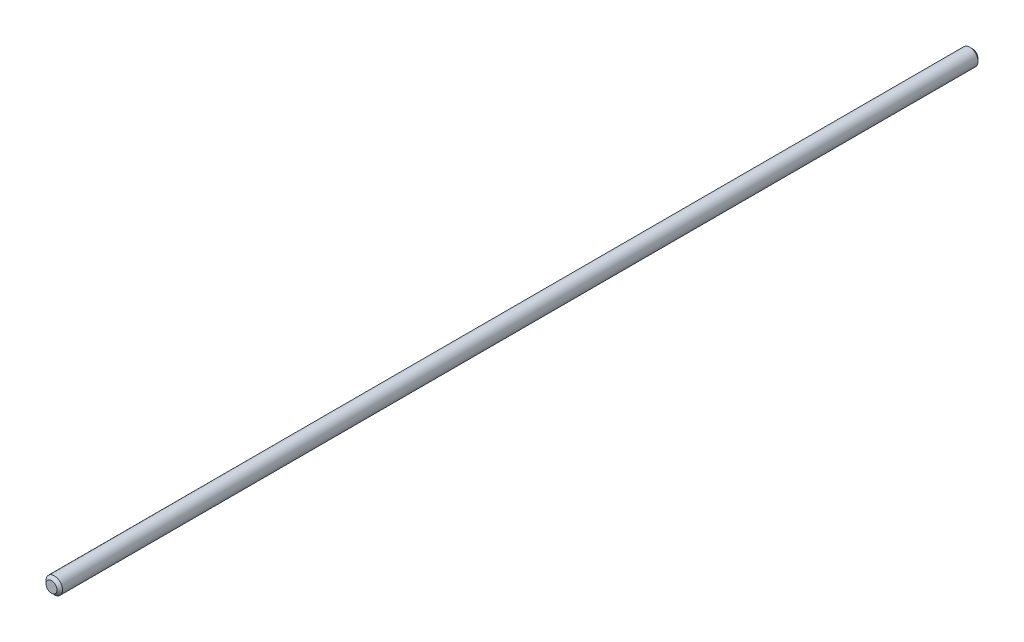
ISO-10303-21;
HEADER;
FILE_DESCRIPTION(('STEP AP214'),'2;1');
FILE_NAME('part.step','',(''),(''),'','','');
FILE_SCHEMA(('AUTOMOTIVE_DESIGN { 1 0 10303 214 1 1 1 1 }'));
ENDSEC;
DATA;
#1=APPLICATION_CONTEXT('core data for automotive mechanical design processes');
#2=APPLICATION_PROTOCOL_DEFINITION('international standard','automotive_design',2000,#1);
#3=PRODUCT_CONTEXT('',#1,'mechanical');
#4=PRODUCT('Part','Part','',(#3));
#5=PRODUCT_RELATED_PRODUCT_CATEGORY('part','',(#4));
#6=PRODUCT_DEFINITION_FORMATION('','',#4);
#7=PRODUCT_DEFINITION_CONTEXT('part definition',#1,'design');
#8=PRODUCT_DEFINITION('design','',#6,#7);
#9=PRODUCT_DEFINITION_SHAPE('','',#8);
#10=(LENGTH_UNIT() NAMED_UNIT(*) SI_UNIT(.MILLI.,.METRE.));
#11=(NAMED_UNIT(*) PLANE_ANGLE_UNIT() SI_UNIT($,.RADIAN.));
#12=(NAMED_UNIT(*) SI_UNIT($,.STERADIAN.) SOLID_ANGLE_UNIT());
#13=UNCERTAINTY_MEASURE_WITH_UNIT(LENGTH_MEASURE(1.E-05),#10,'distance_accuracy_value','');
#14=(GEOMETRIC_REPRESENTATION_CONTEXT(3) GLOBAL_UNCERTAINTY_ASSIGNED_CONTEXT((#13)) GLOBAL_UNIT_ASSIGNED_CONTEXT((#10,
#11,#12)) REPRESENTATION_CONTEXT('',''));
#15=CARTESIAN_POINT('',(0.,0.,0.));
#16=DIRECTION('',(0.,0.,1.));
#17=DIRECTION('',(1.,0.,0.));
#18=AXIS2_PLACEMENT_3D('',#15,#16,#17);
#19=CARTESIAN_POINT('',(0.,0.,335.));
#20=DIRECTION('',(0.,0.,-1.));
#21=DIRECTION('',(-1.,0.,0.));
#22=AXIS2_PLACEMENT_3D('',#19,#20,#21);
#23=CYLINDRICAL_SURFACE('',#22,3.);
#24=CARTESIAN_POINT('',(0.,0.,1.));
#25=DIRECTION('',(0.,0.,1.));
#26=DIRECTION('',(1.,0.,0.));
#27=AXIS2_PLACEMENT_3D('',#24,#25,#26);
#28=CIRCLE('',#27,3.);
#29=CARTESIAN_POINT('',(3.,0.,1.));
#30=VERTEX_POINT('',#29);
#31=EDGE_CURVE('E41',#30,#30,#28,.T.);
#32=ORIENTED_EDGE('',*,*,#31,.T.);
#33=EDGE_LOOP('',(#32));
#34=FACE_BOUND('',#33,.T.);
#35=CARTESIAN_POINT('',(0.,0.,334.));
#36=DIRECTION('',(0.,0.,1.));
#37=DIRECTION('',(1.,0.,0.));
#38=AXIS2_PLACEMENT_3D('',#35,#36,#37);
#39=CIRCLE('',#38,3.);
#40=CARTESIAN_POINT('',(3.,0.,334.));
#41=VERTEX_POINT('',#40);
#42=EDGE_CURVE('E45',#41,#41,#39,.F.);
#43=ORIENTED_EDGE('',*,*,#42,.T.);
#44=EDGE_LOOP('',(#43));
#45=FACE_BOUND('',#44,.T.);
#46=ADVANCED_FACE('F31',(#34,#45),#23,.T.);
#47=CARTESIAN_POINT('',(0.,0.,335.));
#48=DIRECTION('',(0.,0.,1.));
#49=DIRECTION('',(1.,0.,0.));
#50=AXIS2_PLACEMENT_3D('',#47,#48,#49);
#51=PLANE('',#50);
#52=CARTESIAN_POINT('',(0.,0.,335.));
#53=DIRECTION('',(0.,0.,1.));
#54=DIRECTION('',(1.,0.,0.));
#55=AXIS2_PLACEMENT_3D('',#52,#53,#54);
#56=CIRCLE('',#55,1.99999999999998);
#57=CARTESIAN_POINT('',(1.99999999999998,0.,335.));
#58=VERTEX_POINT('',#57);
#59=EDGE_CURVE('E10',#58,#58,#56,.T.);
#60=ORIENTED_EDGE('',*,*,#59,.T.);
#61=EDGE_LOOP('',(#60));
#62=FACE_BOUND('',#61,.T.);
#63=ADVANCED_FACE('F63',(#62),#51,.T.);
#64=CARTESIAN_POINT('',(0.,0.,0.));
#65=DIRECTION('',(0.,0.,1.));
#66=DIRECTION('',(1.,0.,0.));
#67=AXIS2_PLACEMENT_3D('',#64,#65,#66);
#68=PLANE('',#67);
#69=CARTESIAN_POINT('',(0.,0.,0.));
#70=DIRECTION('',(0.,0.,1.));
#71=DIRECTION('',(1.,0.,0.));
#72=AXIS2_PLACEMENT_3D('',#69,#70,#71);
#73=CIRCLE('',#72,1.99999999999999);
#74=CARTESIAN_POINT('',(1.99999999999999,0.,0.));
#75=VERTEX_POINT('',#74);
#76=EDGE_CURVE('E37',#75,#75,#73,.F.);
#77=ORIENTED_EDGE('',*,*,#76,.T.);
#78=EDGE_LOOP('',(#77));
#79=FACE_BOUND('',#78,.T.);
#80=ADVANCED_FACE('F60',(#79),#68,.F.);
#81=CARTESIAN_POINT('',(0.,0.,1.));
#82=DIRECTION('',(0.,0.,1.));
#83=DIRECTION('',(1.,0.,0.));
#84=AXIS2_PLACEMENT_3D('',#81,#82,#83);
#85=CONICAL_SURFACE('',#84,3.,0.785398163397451);
#86=ORIENTED_EDGE('',*,*,#76,.F.);
#87=EDGE_LOOP('',(#86));
#88=FACE_BOUND('',#87,.T.);
#89=ORIENTED_EDGE('',*,*,#31,.F.);
#90=EDGE_LOOP('',(#89));
#91=FACE_BOUND('',#90,.T.);
#92=ADVANCED_FACE('F55',(#88,#91),#85,.T.);
#93=CARTESIAN_POINT('',(0.,0.,335.));
#94=DIRECTION('',(0.,0.,-1.));
#95=DIRECTION('',(-1.,0.,0.));
#96=AXIS2_PLACEMENT_3D('',#93,#94,#95);
#97=CONICAL_SURFACE('',#96,1.99999999999998,0.785398163397457);
#98=ORIENTED_EDGE('',*,*,#42,.F.);
#99=EDGE_LOOP('',(#98));
#100=FACE_BOUND('',#99,.T.);
#101=ORIENTED_EDGE('',*,*,#59,.F.);
#102=EDGE_LOOP('',(#101));
#103=FACE_BOUND('',#102,.T.);
#104=ADVANCED_FACE('F52',(#100,#103),#97,.T.);
#105=CLOSED_SHELL('',(#46,#63,#80,#92,#104));
#106=MANIFOLD_SOLID_BREP('B2',#105);
#107=ADVANCED_BREP_SHAPE_REPRESENTATION('',(#18,#106),#14);
#108=SHAPE_DEFINITION_REPRESENTATION(#9,#107);
ENDSEC;
END-ISO-10303-21;
